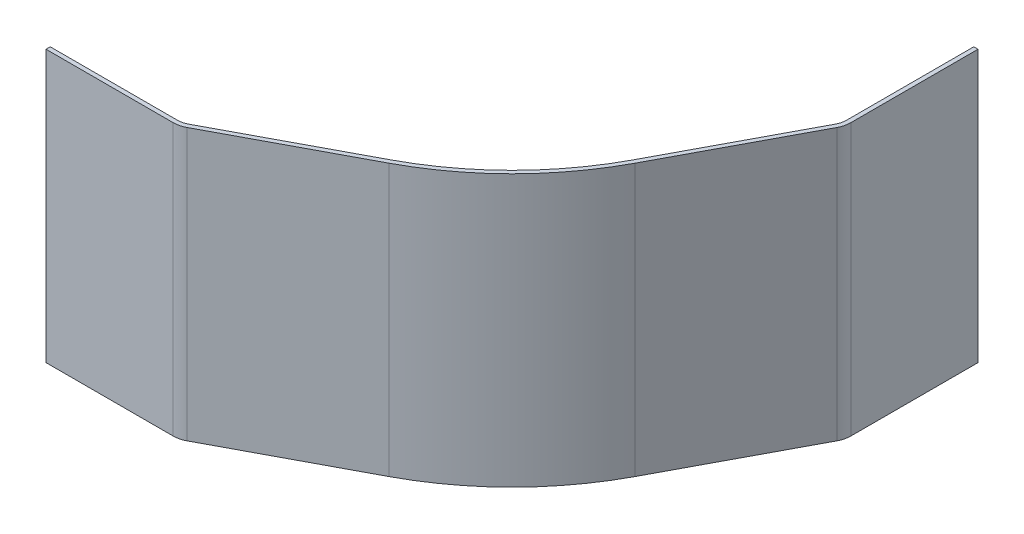
ISO-10303-21;
HEADER;
FILE_DESCRIPTION(('STEP AP214'),'2;1');
FILE_NAME('part.step','',(''),(''),'','','');
FILE_SCHEMA(('AUTOMOTIVE_DESIGN { 1 0 10303 214 1 1 1 1 }'));
ENDSEC;
DATA;
#1=APPLICATION_CONTEXT('core data for automotive mechanical design processes');
#2=APPLICATION_PROTOCOL_DEFINITION('international standard','automotive_design',2000,#1);
#3=PRODUCT_CONTEXT('',#1,'mechanical');
#4=PRODUCT('Part','Part','',(#3));
#5=PRODUCT_RELATED_PRODUCT_CATEGORY('part','',(#4));
#6=PRODUCT_DEFINITION_FORMATION('','',#4);
#7=PRODUCT_DEFINITION_CONTEXT('part definition',#1,'design');
#8=PRODUCT_DEFINITION('design','',#6,#7);
#9=PRODUCT_DEFINITION_SHAPE('','',#8);
#10=(LENGTH_UNIT() NAMED_UNIT(*) SI_UNIT(.MILLI.,.METRE.));
#11=(NAMED_UNIT(*) PLANE_ANGLE_UNIT() SI_UNIT($,.RADIAN.));
#12=(NAMED_UNIT(*) SI_UNIT($,.STERADIAN.) SOLID_ANGLE_UNIT());
#13=UNCERTAINTY_MEASURE_WITH_UNIT(LENGTH_MEASURE(1.E-05),#10,'distance_accuracy_value','');
#14=(GEOMETRIC_REPRESENTATION_CONTEXT(3) GLOBAL_UNCERTAINTY_ASSIGNED_CONTEXT((#13)) GLOBAL_UNIT_ASSIGNED_CONTEXT((#10,
#11,#12)) REPRESENTATION_CONTEXT('',''));
#15=CARTESIAN_POINT('',(0.,0.,0.));
#16=DIRECTION('',(0.,0.,1.));
#17=DIRECTION('',(1.,0.,0.));
#18=AXIS2_PLACEMENT_3D('',#15,#16,#17);
#19=CARTESIAN_POINT('',(18.375,-8.,-0.219999999999992));
#20=DIRECTION('',(0.,1.,0.));
#21=DIRECTION('',(0.,0.,1.));
#22=AXIS2_PLACEMENT_3D('',#19,#20,#21);
#23=CYLINDRICAL_SURFACE('',#22,1.125);
#24=CARTESIAN_POINT('',(18.375,8.,-0.219999999999992));
#25=DIRECTION('',(0.,1.,0.));
#26=DIRECTION('',(0.,0.,1.));
#27=AXIS2_PLACEMENT_3D('',#24,#25,#26);
#28=CIRCLE('',#27,1.125);
#29=CARTESIAN_POINT('',(19.3685628322334,8.,0.307691101312455));
#30=VERTEX_POINT('',#29);
#31=CARTESIAN_POINT('',(19.5,8.,-0.219999999999997));
#32=VERTEX_POINT('',#31);
#33=EDGE_CURVE('E175',#30,#32,#28,.T.);
#34=ORIENTED_EDGE('',*,*,#33,.T.);
#35=DIRECTION('',(0.,1.,0.));
#36=VECTOR('',#35,1.);
#37=CARTESIAN_POINT('',(19.5,-8.,-0.219999999999997));
#38=LINE('',#37,#36);
#39=CARTESIAN_POINT('',(19.5,-8.,-0.219999999999997));
#40=VERTEX_POINT('',#39);
#41=EDGE_CURVE('E11',#40,#32,#38,.T.);
#42=ORIENTED_EDGE('',*,*,#41,.F.);
#43=CARTESIAN_POINT('',(18.375,-8.,-0.219999999999992));
#44=DIRECTION('',(0.,1.,0.));
#45=DIRECTION('',(0.,0.,1.));
#46=AXIS2_PLACEMENT_3D('',#43,#44,#45);
#47=CIRCLE('',#46,1.125);
#48=CARTESIAN_POINT('',(19.3685628322334,-8.,0.307691101312455));
#49=VERTEX_POINT('',#48);
#50=EDGE_CURVE('E205',#49,#40,#47,.T.);
#51=ORIENTED_EDGE('',*,*,#50,.F.);
#52=DIRECTION('',(0.,1.,0.));
#53=VECTOR('',#52,1.);
#54=CARTESIAN_POINT('',(19.3685628322334,-8.,0.307691101312455));
#55=LINE('',#54,#53);
#56=EDGE_CURVE('E171',#49,#30,#55,.T.);
#57=ORIENTED_EDGE('',*,*,#56,.T.);
#58=EDGE_LOOP('',(#34,#42,#51,#57));
#59=FACE_BOUND('',#58,.T.);
#60=ADVANCED_FACE('F31',(#59),#23,.F.);
#61=CARTESIAN_POINT('',(19.5,-8.,-0.219999999999997));
#62=DIRECTION('',(1.,0.,0.));
#63=DIRECTION('',(0.,0.,-1.));
#64=AXIS2_PLACEMENT_3D('',#61,#62,#63);
#65=PLANE('',#64);
#66=DIRECTION('',(0.,0.,-1.));
#67=VECTOR('',#66,1.);
#68=CARTESIAN_POINT('',(19.5,8.,-0.219999999999997));
#69=LINE('',#68,#67);
#70=CARTESIAN_POINT('',(19.5,8.,-7.72));
#71=VERTEX_POINT('',#70);
#72=EDGE_CURVE('E178',#32,#71,#69,.T.);
#73=ORIENTED_EDGE('',*,*,#72,.T.);
#74=DIRECTION('',(0.,1.,0.));
#75=VECTOR('',#74,1.);
#76=CARTESIAN_POINT('',(19.5,-8.,-7.72));
#77=LINE('',#76,#75);
#78=CARTESIAN_POINT('',(19.5,-8.,-7.72));
#79=VERTEX_POINT('',#78);
#80=EDGE_CURVE('E39',#79,#71,#77,.T.);
#81=ORIENTED_EDGE('',*,*,#80,.F.);
#82=DIRECTION('',(0.,0.,-1.));
#83=VECTOR('',#82,1.);
#84=CARTESIAN_POINT('',(19.5,-8.,-0.219999999999997));
#85=LINE('',#84,#83);
#86=EDGE_CURVE('E114',#40,#79,#85,.T.);
#87=ORIENTED_EDGE('',*,*,#86,.F.);
#88=ORIENTED_EDGE('',*,*,#41,.T.);
#89=EDGE_LOOP('',(#73,#81,#87,#88));
#90=FACE_BOUND('',#89,.T.);
#91=ADVANCED_FACE('F303',(#90),#65,.F.);
#92=CARTESIAN_POINT('',(19.5,-8.,-7.72));
#93=DIRECTION('',(0.,0.,1.));
#94=DIRECTION('',(1.,0.,0.));
#95=AXIS2_PLACEMENT_3D('',#92,#93,#94);
#96=PLANE('',#95);
#97=DIRECTION('',(1.,0.,0.));
#98=VECTOR('',#97,1.);
#99=CARTESIAN_POINT('',(19.5,8.,-7.72));
#100=LINE('',#99,#98);
#101=CARTESIAN_POINT('',(19.75,8.,-7.72));
#102=VERTEX_POINT('',#101);
#103=EDGE_CURVE('E180',#71,#102,#100,.T.);
#104=ORIENTED_EDGE('',*,*,#103,.T.);
#105=DIRECTION('',(0.,1.,0.));
#106=VECTOR('',#105,1.);
#107=CARTESIAN_POINT('',(19.75,-8.,-7.72));
#108=LINE('',#107,#106);
#109=CARTESIAN_POINT('',(19.75,-8.,-7.72));
#110=VERTEX_POINT('',#109);
#111=EDGE_CURVE('E236',#110,#102,#108,.T.);
#112=ORIENTED_EDGE('',*,*,#111,.F.);
#113=DIRECTION('',(1.,0.,0.));
#114=VECTOR('',#113,1.);
#115=CARTESIAN_POINT('',(19.5,-8.,-7.72));
#116=LINE('',#115,#114);
#117=EDGE_CURVE('E244',#79,#110,#116,.T.);
#118=ORIENTED_EDGE('',*,*,#117,.F.);
#119=ORIENTED_EDGE('',*,*,#80,.T.);
#120=EDGE_LOOP('',(#104,#112,#118,#119));
#121=FACE_BOUND('',#120,.T.);
#122=ADVANCED_FACE('F242',(#121),#96,.F.);
#123=CARTESIAN_POINT('',(19.75,-8.,-0.219999999999997));
#124=DIRECTION('',(-1.,0.,0.));
#125=DIRECTION('',(0.,0.,1.));
#126=AXIS2_PLACEMENT_3D('',#123,#124,#125);
#127=PLANE('',#126);
#128=DIRECTION('',(0.,0.,1.));
#129=VECTOR('',#128,1.);
#130=CARTESIAN_POINT('',(19.75,8.,-0.219999999999997));
#131=LINE('',#130,#129);
#132=CARTESIAN_POINT('',(19.75,8.,-0.219999999999997));
#133=VERTEX_POINT('',#132);
#134=EDGE_CURVE('E182',#102,#133,#131,.T.);
#135=ORIENTED_EDGE('',*,*,#134,.T.);
#136=DIRECTION('',(0.,1.,0.));
#137=VECTOR('',#136,1.);
#138=CARTESIAN_POINT('',(19.75,-8.,-0.219999999999997));
#139=LINE('',#138,#137);
#140=CARTESIAN_POINT('',(19.75,-8.,-0.219999999999997));
#141=VERTEX_POINT('',#140);
#142=EDGE_CURVE('E233',#141,#133,#139,.T.);
#143=ORIENTED_EDGE('',*,*,#142,.F.);
#144=DIRECTION('',(0.,0.,1.));
#145=VECTOR('',#144,1.);
#146=CARTESIAN_POINT('',(19.75,-8.,-0.219999999999997));
#147=LINE('',#146,#145);
#148=EDGE_CURVE('E262',#110,#141,#147,.T.);
#149=ORIENTED_EDGE('',*,*,#148,.F.);
#150=ORIENTED_EDGE('',*,*,#111,.T.);
#151=EDGE_LOOP('',(#135,#143,#149,#150));
#152=FACE_BOUND('',#151,.T.);
#153=ADVANCED_FACE('F253',(#152),#127,.F.);
#154=CARTESIAN_POINT('',(18.375,-8.,-0.219999999999992));
#155=DIRECTION('',(0.,1.,0.));
#156=DIRECTION('',(0.,0.,1.));
#157=AXIS2_PLACEMENT_3D('',#154,#155,#156);
#158=CYLINDRICAL_SURFACE('',#157,1.375);
#159=CARTESIAN_POINT('',(18.375,8.,-0.219999999999992));
#160=DIRECTION('',(0.,-1.,0.));
#161=DIRECTION('',(0.,0.,1.));
#162=AXIS2_PLACEMENT_3D('',#159,#160,#161);
#163=CIRCLE('',#162,1.375);
#164=CARTESIAN_POINT('',(19.5893545727297,8.,0.424955790492997));
#165=VERTEX_POINT('',#164);
#166=EDGE_CURVE('E184',#133,#165,#163,.T.);
#167=ORIENTED_EDGE('',*,*,#166,.T.);
#168=DIRECTION('',(0.,1.,0.));
#169=VECTOR('',#168,1.);
#170=CARTESIAN_POINT('',(19.5893545727297,-8.,0.424955790492997));
#171=LINE('',#170,#169);
#172=CARTESIAN_POINT('',(19.5893545727297,-8.,0.424955790492997));
#173=VERTEX_POINT('',#172);
#174=EDGE_CURVE('E230',#173,#165,#171,.T.);
#175=ORIENTED_EDGE('',*,*,#174,.F.);
#176=CARTESIAN_POINT('',(18.375,-8.,-0.219999999999992));
#177=DIRECTION('',(0.,-1.,0.));
#178=DIRECTION('',(0.,0.,1.));
#179=AXIS2_PLACEMENT_3D('',#176,#177,#178);
#180=CIRCLE('',#179,1.375);
#181=EDGE_CURVE('E259',#141,#173,#180,.T.);
#182=ORIENTED_EDGE('',*,*,#181,.F.);
#183=ORIENTED_EDGE('',*,*,#142,.T.);
#184=EDGE_LOOP('',(#167,#175,#182,#183));
#185=FACE_BOUND('',#184,.T.);
#186=ADVANCED_FACE('F257',(#185),#158,.T.);
#187=CARTESIAN_POINT('',(15.4554218347418,-8.,8.20852824263807));
#188=DIRECTION('',(-0.883166961985245,0.,-0.469058756722175));
#189=DIRECTION('',(-0.469058756722175,0.,0.883166961985245));
#190=AXIS2_PLACEMENT_3D('',#187,#188,#189);
#191=PLANE('',#190);
#192=DIRECTION('',(-0.469058756722175,0.,0.883166961985245));
#193=VECTOR('',#192,1.);
#194=CARTESIAN_POINT('',(15.4554218347418,8.,8.20852824263807));
#195=LINE('',#194,#193);
#196=CARTESIAN_POINT('',(15.4554218347418,8.,8.20852824263807));
#197=VERTEX_POINT('',#196);
#198=EDGE_CURVE('E186',#165,#197,#195,.T.);
#199=ORIENTED_EDGE('',*,*,#198,.T.);
#200=DIRECTION('',(0.,1.,0.));
#201=VECTOR('',#200,1.);
#202=CARTESIAN_POINT('',(15.4554218347418,-8.,8.20852824263807));
#203=LINE('',#202,#201);
#204=CARTESIAN_POINT('',(15.4554218347418,-8.,8.20852824263807));
#205=VERTEX_POINT('',#204);
#206=EDGE_CURVE('E227',#205,#197,#203,.T.);
#207=ORIENTED_EDGE('',*,*,#206,.F.);
#208=DIRECTION('',(-0.469058756722175,0.,0.883166961985245));
#209=VECTOR('',#208,1.);
#210=CARTESIAN_POINT('',(15.4554218347418,-8.,8.20852824263807));
#211=LINE('',#210,#209);
#212=EDGE_CURVE('E261',#173,#205,#211,.T.);
#213=ORIENTED_EDGE('',*,*,#212,.F.);
#214=ORIENTED_EDGE('',*,*,#174,.T.);
#215=EDGE_LOOP('',(#199,#207,#213,#214));
#216=FACE_BOUND('',#215,.T.);
#217=ADVANCED_FACE('F316',(#216),#191,.F.);
#218=CARTESIAN_POINT('',(0.,-8.,0.));
#219=DIRECTION('',(0.,1.,0.));
#220=DIRECTION('',(0.,0.,1.));
#221=AXIS2_PLACEMENT_3D('',#218,#219,#220);
#222=CYLINDRICAL_SURFACE('',#221,17.5);
#223=CARTESIAN_POINT('',(0.,8.,0.));
#224=DIRECTION('',(0.,-1.,0.));
#225=DIRECTION('',(0.,0.,1.));
#226=AXIS2_PLACEMENT_3D('',#223,#224,#225);
#227=CIRCLE('',#226,17.5);
#228=CARTESIAN_POINT('',(8.20852824263807,8.,15.4554218347418));
#229=VERTEX_POINT('',#228);
#230=EDGE_CURVE('E188',#197,#229,#227,.T.);
#231=ORIENTED_EDGE('',*,*,#230,.T.);
#232=DIRECTION('',(0.,1.,0.));
#233=VECTOR('',#232,1.);
#234=CARTESIAN_POINT('',(8.20852824263807,-8.,15.4554218347418));
#235=LINE('',#234,#233);
#236=CARTESIAN_POINT('',(8.20852824263807,-8.,15.4554218347418));
#237=VERTEX_POINT('',#236);
#238=EDGE_CURVE('E224',#237,#229,#235,.T.);
#239=ORIENTED_EDGE('',*,*,#238,.F.);
#240=CARTESIAN_POINT('',(0.,-8.,0.));
#241=DIRECTION('',(0.,-1.,0.));
#242=DIRECTION('',(0.,0.,1.));
#243=AXIS2_PLACEMENT_3D('',#240,#241,#242);
#244=CIRCLE('',#243,17.5);
#245=EDGE_CURVE('E264',#205,#237,#244,.T.);
#246=ORIENTED_EDGE('',*,*,#245,.F.);
#247=ORIENTED_EDGE('',*,*,#206,.T.);
#248=EDGE_LOOP('',(#231,#239,#246,#247));
#249=FACE_BOUND('',#248,.T.);
#250=ADVANCED_FACE('F319',(#249),#222,.T.);
#251=CARTESIAN_POINT('',(8.20852824263807,-8.,15.4554218347418));
#252=DIRECTION('',(-0.469058756722175,0.,-0.883166961985245));
#253=DIRECTION('',(-0.883166961985245,0.,0.469058756722175));
#254=AXIS2_PLACEMENT_3D('',#251,#252,#253);
#255=PLANE('',#254);
#256=DIRECTION('',(-0.883166961985245,0.,0.469058756722175));
#257=VECTOR('',#256,1.);
#258=CARTESIAN_POINT('',(8.20852824263807,8.,15.4554218347418));
#259=LINE('',#258,#257);
#260=CARTESIAN_POINT('',(0.424955790492991,8.,19.5893545727297));
#261=VERTEX_POINT('',#260);
#262=EDGE_CURVE('E190',#229,#261,#259,.T.);
#263=ORIENTED_EDGE('',*,*,#262,.T.);
#264=DIRECTION('',(0.,1.,0.));
#265=VECTOR('',#264,1.);
#266=CARTESIAN_POINT('',(0.424955790492991,-8.,19.5893545727297));
#267=LINE('',#266,#265);
#268=CARTESIAN_POINT('',(0.424955790492991,-8.,19.5893545727297));
#269=VERTEX_POINT('',#268);
#270=EDGE_CURVE('E221',#269,#261,#267,.T.);
#271=ORIENTED_EDGE('',*,*,#270,.F.);
#272=DIRECTION('',(-0.883166961985245,0.,0.469058756722175));
#273=VECTOR('',#272,1.);
#274=CARTESIAN_POINT('',(8.20852824263807,-8.,15.4554218347418));
#275=LINE('',#274,#273);
#276=EDGE_CURVE('E270',#237,#269,#275,.T.);
#277=ORIENTED_EDGE('',*,*,#276,.F.);
#278=ORIENTED_EDGE('',*,*,#238,.T.);
#279=EDGE_LOOP('',(#263,#271,#277,#278));
#280=FACE_BOUND('',#279,.T.);
#281=ADVANCED_FACE('F323',(#280),#255,.F.);
#282=CARTESIAN_POINT('',(-0.219999999999998,-8.,18.375));
#283=DIRECTION('',(0.,1.,0.));
#284=DIRECTION('',(0.,0.,1.));
#285=AXIS2_PLACEMENT_3D('',#282,#283,#284);
#286=CYLINDRICAL_SURFACE('',#285,1.375);
#287=CARTESIAN_POINT('',(-0.219999999999998,8.,18.375));
#288=DIRECTION('',(0.,-1.,0.));
#289=DIRECTION('',(0.,0.,-1.));
#290=AXIS2_PLACEMENT_3D('',#287,#288,#289);
#291=CIRCLE('',#290,1.375);
#292=CARTESIAN_POINT('',(-0.219999999999998,8.,19.75));
#293=VERTEX_POINT('',#292);
#294=EDGE_CURVE('E192',#261,#293,#291,.T.);
#295=ORIENTED_EDGE('',*,*,#294,.T.);
#296=DIRECTION('',(0.,1.,0.));
#297=VECTOR('',#296,1.);
#298=CARTESIAN_POINT('',(-0.219999999999998,-8.,19.75));
#299=LINE('',#298,#297);
#300=CARTESIAN_POINT('',(-0.219999999999998,-8.,19.75));
#301=VERTEX_POINT('',#300);
#302=EDGE_CURVE('E218',#301,#293,#299,.T.);
#303=ORIENTED_EDGE('',*,*,#302,.F.);
#304=CARTESIAN_POINT('',(-0.219999999999998,-8.,18.375));
#305=DIRECTION('',(0.,-1.,0.));
#306=DIRECTION('',(0.,0.,-1.));
#307=AXIS2_PLACEMENT_3D('',#304,#305,#306);
#308=CIRCLE('',#307,1.375);
#309=EDGE_CURVE('E272',#269,#301,#308,.T.);
#310=ORIENTED_EDGE('',*,*,#309,.F.);
#311=ORIENTED_EDGE('',*,*,#270,.T.);
#312=EDGE_LOOP('',(#295,#303,#310,#311));
#313=FACE_BOUND('',#312,.T.);
#314=ADVANCED_FACE('F327',(#313),#286,.T.);
#315=CARTESIAN_POINT('',(-0.219999999999998,-8.,19.75));
#316=DIRECTION('',(0.,0.,-1.));
#317=DIRECTION('',(-1.,0.,0.));
#318=AXIS2_PLACEMENT_3D('',#315,#316,#317);
#319=PLANE('',#318);
#320=DIRECTION('',(-1.,0.,0.));
#321=VECTOR('',#320,1.);
#322=CARTESIAN_POINT('',(-0.219999999999998,8.,19.75));
#323=LINE('',#322,#321);
#324=CARTESIAN_POINT('',(-7.72,8.,19.75));
#325=VERTEX_POINT('',#324);
#326=EDGE_CURVE('E194',#293,#325,#323,.T.);
#327=ORIENTED_EDGE('',*,*,#326,.T.);
#328=DIRECTION('',(0.,1.,0.));
#329=VECTOR('',#328,1.);
#330=CARTESIAN_POINT('',(-7.72,-8.,19.75));
#331=LINE('',#330,#329);
#332=CARTESIAN_POINT('',(-7.72,-8.,19.75));
#333=VERTEX_POINT('',#332);
#334=EDGE_CURVE('E215',#333,#325,#331,.T.);
#335=ORIENTED_EDGE('',*,*,#334,.F.);
#336=DIRECTION('',(-1.,0.,0.));
#337=VECTOR('',#336,1.);
#338=CARTESIAN_POINT('',(-0.219999999999998,-8.,19.75));
#339=LINE('',#338,#337);
#340=EDGE_CURVE('E274',#301,#333,#339,.T.);
#341=ORIENTED_EDGE('',*,*,#340,.F.);
#342=ORIENTED_EDGE('',*,*,#302,.T.);
#343=EDGE_LOOP('',(#327,#335,#341,#342));
#344=FACE_BOUND('',#343,.T.);
#345=ADVANCED_FACE('F331',(#344),#319,.F.);
#346=CARTESIAN_POINT('',(-7.72,-8.,19.5));
#347=DIRECTION('',(1.,0.,0.));
#348=DIRECTION('',(0.,0.,-1.));
#349=AXIS2_PLACEMENT_3D('',#346,#347,#348);
#350=PLANE('',#349);
#351=DIRECTION('',(0.,0.,-1.));
#352=VECTOR('',#351,1.);
#353=CARTESIAN_POINT('',(-7.72,8.,19.5));
#354=LINE('',#353,#352);
#355=CARTESIAN_POINT('',(-7.72,8.,19.5));
#356=VERTEX_POINT('',#355);
#357=EDGE_CURVE('E196',#325,#356,#354,.T.);
#358=ORIENTED_EDGE('',*,*,#357,.T.);
#359=DIRECTION('',(0.,1.,0.));
#360=VECTOR('',#359,1.);
#361=CARTESIAN_POINT('',(-7.72,-8.,19.5));
#362=LINE('',#361,#360);
#363=CARTESIAN_POINT('',(-7.72,-8.,19.5));
#364=VERTEX_POINT('',#363);
#365=EDGE_CURVE('E212',#364,#356,#362,.T.);
#366=ORIENTED_EDGE('',*,*,#365,.F.);
#367=DIRECTION('',(0.,0.,-1.));
#368=VECTOR('',#367,1.);
#369=CARTESIAN_POINT('',(-7.72,-8.,19.5));
#370=LINE('',#369,#368);
#371=EDGE_CURVE('E276',#333,#364,#370,.T.);
#372=ORIENTED_EDGE('',*,*,#371,.F.);
#373=ORIENTED_EDGE('',*,*,#334,.T.);
#374=EDGE_LOOP('',(#358,#366,#372,#373));
#375=FACE_BOUND('',#374,.T.);
#376=ADVANCED_FACE('F335',(#375),#350,.F.);
#377=CARTESIAN_POINT('',(-0.219999999999998,-8.,19.5));
#378=DIRECTION('',(0.,0.,1.));
#379=DIRECTION('',(1.,0.,0.));
#380=AXIS2_PLACEMENT_3D('',#377,#378,#379);
#381=PLANE('',#380);
#382=DIRECTION('',(1.,0.,0.));
#383=VECTOR('',#382,1.);
#384=CARTESIAN_POINT('',(-0.219999999999998,8.,19.5));
#385=LINE('',#384,#383);
#386=CARTESIAN_POINT('',(-0.219999999999998,8.,19.5));
#387=VERTEX_POINT('',#386);
#388=EDGE_CURVE('E198',#356,#387,#385,.T.);
#389=ORIENTED_EDGE('',*,*,#388,.T.);
#390=DIRECTION('',(0.,1.,0.));
#391=VECTOR('',#390,1.);
#392=CARTESIAN_POINT('',(-0.219999999999998,-8.,19.5));
#393=LINE('',#392,#391);
#394=CARTESIAN_POINT('',(-0.219999999999998,-8.,19.5));
#395=VERTEX_POINT('',#394);
#396=EDGE_CURVE('E209',#395,#387,#393,.T.);
#397=ORIENTED_EDGE('',*,*,#396,.F.);
#398=DIRECTION('',(1.,0.,0.));
#399=VECTOR('',#398,1.);
#400=CARTESIAN_POINT('',(-0.219999999999998,-8.,19.5));
#401=LINE('',#400,#399);
#402=EDGE_CURVE('E278',#364,#395,#401,.T.);
#403=ORIENTED_EDGE('',*,*,#402,.F.);
#404=ORIENTED_EDGE('',*,*,#365,.T.);
#405=EDGE_LOOP('',(#389,#397,#403,#404));
#406=FACE_BOUND('',#405,.T.);
#407=ADVANCED_FACE('F284',(#406),#381,.F.);
#408=CARTESIAN_POINT('',(-0.219999999999998,-8.,18.375));
#409=DIRECTION('',(0.,1.,0.));
#410=DIRECTION('',(0.,0.,1.));
#411=AXIS2_PLACEMENT_3D('',#408,#409,#410);
#412=CYLINDRICAL_SURFACE('',#411,1.125);
#413=CARTESIAN_POINT('',(-0.219999999999998,8.,18.375));
#414=DIRECTION('',(0.,1.,0.));
#415=DIRECTION('',(0.,0.,-1.));
#416=AXIS2_PLACEMENT_3D('',#413,#414,#415);
#417=CIRCLE('',#416,1.125);
#418=CARTESIAN_POINT('',(0.307691101312448,8.,19.3685628322334));
#419=VERTEX_POINT('',#418);
#420=EDGE_CURVE('E200',#387,#419,#417,.T.);
#421=ORIENTED_EDGE('',*,*,#420,.T.);
#422=DIRECTION('',(0.,1.,0.));
#423=VECTOR('',#422,1.);
#424=CARTESIAN_POINT('',(0.307691101312448,-8.,19.3685628322334));
#425=LINE('',#424,#423);
#426=CARTESIAN_POINT('',(0.307691101312448,-8.,19.3685628322334));
#427=VERTEX_POINT('',#426);
#428=EDGE_CURVE('E166',#427,#419,#425,.T.);
#429=ORIENTED_EDGE('',*,*,#428,.F.);
#430=CARTESIAN_POINT('',(-0.219999999999998,-8.,18.375));
#431=DIRECTION('',(0.,1.,0.));
#432=DIRECTION('',(0.,0.,-1.));
#433=AXIS2_PLACEMENT_3D('',#430,#431,#432);
#434=CIRCLE('',#433,1.125);
#435=EDGE_CURVE('E157',#395,#427,#434,.T.);
#436=ORIENTED_EDGE('',*,*,#435,.F.);
#437=ORIENTED_EDGE('',*,*,#396,.T.);
#438=EDGE_LOOP('',(#421,#429,#436,#437));
#439=FACE_BOUND('',#438,.T.);
#440=ADVANCED_FACE('F288',(#439),#412,.F.);
#441=CARTESIAN_POINT('',(8.09126355345752,-8.,15.2346300942455));
#442=DIRECTION('',(0.469058756722175,0.,0.883166961985245));
#443=DIRECTION('',(0.883166961985245,0.,-0.469058756722175));
#444=AXIS2_PLACEMENT_3D('',#441,#442,#443);
#445=PLANE('',#444);
#446=DIRECTION('',(0.883166961985245,0.,-0.469058756722175));
#447=VECTOR('',#446,1.);
#448=CARTESIAN_POINT('',(8.09126355345752,8.,15.2346300942455));
#449=LINE('',#448,#447);
#450=CARTESIAN_POINT('',(8.09126355345752,8.,15.2346300942455));
#451=VERTEX_POINT('',#450);
#452=EDGE_CURVE('E165',#419,#451,#449,.T.);
#453=ORIENTED_EDGE('',*,*,#452,.T.);
#454=DIRECTION('',(0.,1.,0.));
#455=VECTOR('',#454,1.);
#456=CARTESIAN_POINT('',(8.09126355345752,-8.,15.2346300942455));
#457=LINE('',#456,#455);
#458=CARTESIAN_POINT('',(8.09126355345752,-8.,15.2346300942455));
#459=VERTEX_POINT('',#458);
#460=EDGE_CURVE('E162',#459,#451,#457,.T.);
#461=ORIENTED_EDGE('',*,*,#460,.F.);
#462=DIRECTION('',(0.883166961985245,0.,-0.469058756722175));
#463=VECTOR('',#462,1.);
#464=CARTESIAN_POINT('',(8.09126355345752,-8.,15.2346300942455));
#465=LINE('',#464,#463);
#466=EDGE_CURVE('E151',#427,#459,#465,.T.);
#467=ORIENTED_EDGE('',*,*,#466,.F.);
#468=ORIENTED_EDGE('',*,*,#428,.T.);
#469=EDGE_LOOP('',(#453,#461,#467,#468));
#470=FACE_BOUND('',#469,.T.);
#471=ADVANCED_FACE('F163',(#470),#445,.F.);
#472=CARTESIAN_POINT('',(0.,-8.,0.));
#473=DIRECTION('',(0.,1.,0.));
#474=DIRECTION('',(0.,0.,1.));
#475=AXIS2_PLACEMENT_3D('',#472,#473,#474);
#476=CYLINDRICAL_SURFACE('',#475,17.25);
#477=CARTESIAN_POINT('',(0.,8.,0.));
#478=DIRECTION('',(0.,1.,0.));
#479=DIRECTION('',(0.,0.,1.));
#480=AXIS2_PLACEMENT_3D('',#477,#478,#479);
#481=CIRCLE('',#480,17.25);
#482=CARTESIAN_POINT('',(15.2346300942455,8.,8.09126355345752));
#483=VERTEX_POINT('',#482);
#484=EDGE_CURVE('E100',#451,#483,#481,.T.);
#485=ORIENTED_EDGE('',*,*,#484,.T.);
#486=DIRECTION('',(0.,1.,0.));
#487=VECTOR('',#486,1.);
#488=CARTESIAN_POINT('',(15.2346300942455,-8.,8.09126355345752));
#489=LINE('',#488,#487);
#490=CARTESIAN_POINT('',(15.2346300942455,-8.,8.09126355345752));
#491=VERTEX_POINT('',#490);
#492=EDGE_CURVE('E167',#491,#483,#489,.T.);
#493=ORIENTED_EDGE('',*,*,#492,.F.);
#494=CARTESIAN_POINT('',(0.,-8.,0.));
#495=DIRECTION('',(0.,1.,0.));
#496=DIRECTION('',(0.,0.,1.));
#497=AXIS2_PLACEMENT_3D('',#494,#495,#496);
#498=CIRCLE('',#497,17.25);
#499=EDGE_CURVE('E155',#459,#491,#498,.T.);
#500=ORIENTED_EDGE('',*,*,#499,.F.);
#501=ORIENTED_EDGE('',*,*,#460,.T.);
#502=EDGE_LOOP('',(#485,#493,#500,#501));
#503=FACE_BOUND('',#502,.T.);
#504=ADVANCED_FACE('F169',(#503),#476,.F.);
#505=CARTESIAN_POINT('',(15.2346300942455,-8.,8.09126355345753));
#506=DIRECTION('',(0.883166961985245,0.,0.469058756722175));
#507=DIRECTION('',(0.469058756722175,0.,-0.883166961985245));
#508=AXIS2_PLACEMENT_3D('',#505,#506,#507);
#509=PLANE('',#508);
#510=DIRECTION('',(0.469058756722175,0.,-0.883166961985245));
#511=VECTOR('',#510,1.);
#512=CARTESIAN_POINT('',(15.2346300942455,8.,8.09126355345753));
#513=LINE('',#512,#511);
#514=EDGE_CURVE('E106',#483,#30,#513,.T.);
#515=ORIENTED_EDGE('',*,*,#514,.T.);
#516=ORIENTED_EDGE('',*,*,#56,.F.);
#517=DIRECTION('',(0.469058756722175,0.,-0.883166961985245));
#518=VECTOR('',#517,1.);
#519=CARTESIAN_POINT('',(15.2346300942455,-8.,8.09126355345753));
#520=LINE('',#519,#518);
#521=EDGE_CURVE('E47',#491,#49,#520,.T.);
#522=ORIENTED_EDGE('',*,*,#521,.F.);
#523=ORIENTED_EDGE('',*,*,#492,.T.);
#524=EDGE_LOOP('',(#515,#516,#522,#523));
#525=FACE_BOUND('',#524,.T.);
#526=ADVANCED_FACE('F292',(#525),#509,.F.);
#527=CARTESIAN_POINT('',(18.375,-8.,-0.219999999999992));
#528=DIRECTION('',(0.,1.,0.));
#529=DIRECTION('',(0.,0.,1.));
#530=AXIS2_PLACEMENT_3D('',#527,#528,#529);
#531=PLANE('',#530);
#532=ORIENTED_EDGE('',*,*,#50,.T.);
#533=ORIENTED_EDGE('',*,*,#86,.T.);
#534=ORIENTED_EDGE('',*,*,#117,.T.);
#535=ORIENTED_EDGE('',*,*,#148,.T.);
#536=ORIENTED_EDGE('',*,*,#181,.T.);
#537=ORIENTED_EDGE('',*,*,#212,.T.);
#538=ORIENTED_EDGE('',*,*,#245,.T.);
#539=ORIENTED_EDGE('',*,*,#276,.T.);
#540=ORIENTED_EDGE('',*,*,#309,.T.);
#541=ORIENTED_EDGE('',*,*,#340,.T.);
#542=ORIENTED_EDGE('',*,*,#371,.T.);
#543=ORIENTED_EDGE('',*,*,#402,.T.);
#544=ORIENTED_EDGE('',*,*,#435,.T.);
#545=ORIENTED_EDGE('',*,*,#466,.T.);
#546=ORIENTED_EDGE('',*,*,#499,.T.);
#547=ORIENTED_EDGE('',*,*,#521,.T.);
#548=EDGE_LOOP('',(#532,#533,#534,#535,#536,#537,#538,#539,#540,#541,#542,#543,#544,#545,#546,#547));
#549=FACE_BOUND('',#548,.T.);
#550=ADVANCED_FACE('F153',(#549),#531,.F.);
#551=CARTESIAN_POINT('',(18.375,8.,-0.219999999999992));
#552=DIRECTION('',(0.,1.,0.));
#553=DIRECTION('',(0.,0.,1.));
#554=AXIS2_PLACEMENT_3D('',#551,#552,#553);
#555=PLANE('',#554);
#556=ORIENTED_EDGE('',*,*,#33,.F.);
#557=ORIENTED_EDGE('',*,*,#514,.F.);
#558=ORIENTED_EDGE('',*,*,#484,.F.);
#559=ORIENTED_EDGE('',*,*,#452,.F.);
#560=ORIENTED_EDGE('',*,*,#420,.F.);
#561=ORIENTED_EDGE('',*,*,#388,.F.);
#562=ORIENTED_EDGE('',*,*,#357,.F.);
#563=ORIENTED_EDGE('',*,*,#326,.F.);
#564=ORIENTED_EDGE('',*,*,#294,.F.);
#565=ORIENTED_EDGE('',*,*,#262,.F.);
#566=ORIENTED_EDGE('',*,*,#230,.F.);
#567=ORIENTED_EDGE('',*,*,#198,.F.);
#568=ORIENTED_EDGE('',*,*,#166,.F.);
#569=ORIENTED_EDGE('',*,*,#134,.F.);
#570=ORIENTED_EDGE('',*,*,#103,.F.);
#571=ORIENTED_EDGE('',*,*,#72,.F.);
#572=EDGE_LOOP('',(#556,#557,#558,#559,#560,#561,#562,#563,#564,#565,#566,#567,#568,#569,#570,#571));
#573=FACE_BOUND('',#572,.T.);
#574=ADVANCED_FACE('F248',(#573),#555,.T.);
#575=CLOSED_SHELL('',(#60,#91,#122,#153,#186,#217,#250,#281,#314,#345,#376,#407,#440,#471,#504,
#526,#550,#574));
#576=MANIFOLD_SOLID_BREP('B2',#575);
#577=ADVANCED_BREP_SHAPE_REPRESENTATION('',(#18,#576),#14);
#578=SHAPE_DEFINITION_REPRESENTATION(#9,#577);
ENDSEC;
END-ISO-10303-21;
